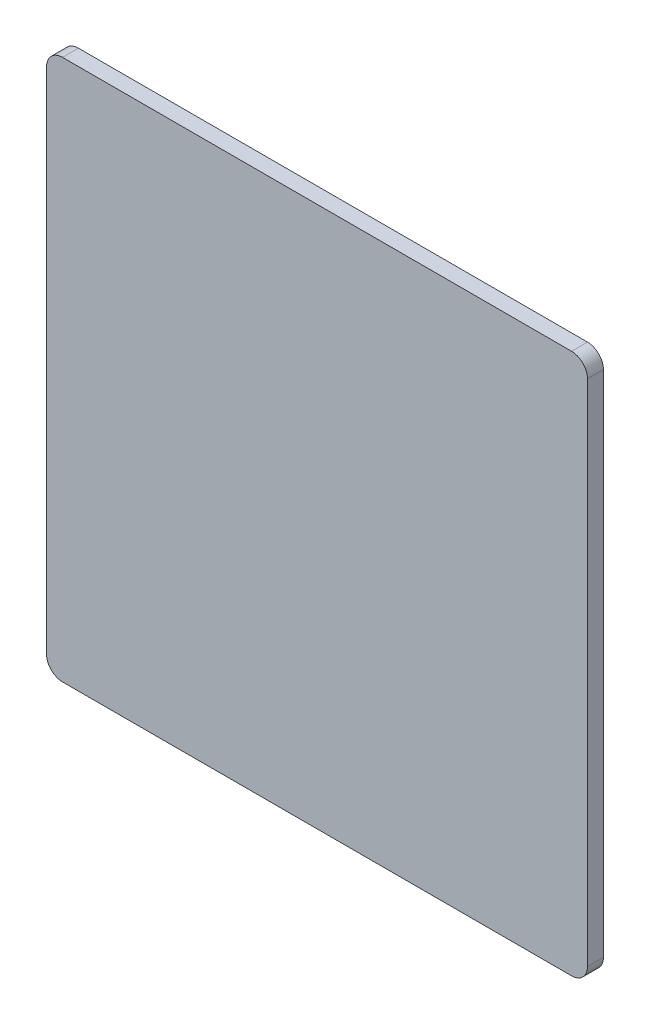
ISO-10303-21;
HEADER;
FILE_DESCRIPTION(('STEP AP214'),'2;1');
FILE_NAME('part.step','',(''),(''),'','','');
FILE_SCHEMA(('AUTOMOTIVE_DESIGN { 1 0 10303 214 1 1 1 1 }'));
ENDSEC;
DATA;
#1=APPLICATION_CONTEXT('core data for automotive mechanical design processes');
#2=APPLICATION_PROTOCOL_DEFINITION('international standard','automotive_design',2000,#1);
#3=PRODUCT_CONTEXT('',#1,'mechanical');
#4=PRODUCT('Part','Part','',(#3));
#5=PRODUCT_RELATED_PRODUCT_CATEGORY('part','',(#4));
#6=PRODUCT_DEFINITION_FORMATION('','',#4);
#7=PRODUCT_DEFINITION_CONTEXT('part definition',#1,'design');
#8=PRODUCT_DEFINITION('design','',#6,#7);
#9=PRODUCT_DEFINITION_SHAPE('','',#8);
#10=(LENGTH_UNIT() NAMED_UNIT(*) SI_UNIT(.MILLI.,.METRE.));
#11=(NAMED_UNIT(*) PLANE_ANGLE_UNIT() SI_UNIT($,.RADIAN.));
#12=(NAMED_UNIT(*) SI_UNIT($,.STERADIAN.) SOLID_ANGLE_UNIT());
#13=UNCERTAINTY_MEASURE_WITH_UNIT(LENGTH_MEASURE(1.E-05),#10,'distance_accuracy_value','');
#14=(GEOMETRIC_REPRESENTATION_CONTEXT(3) GLOBAL_UNCERTAINTY_ASSIGNED_CONTEXT((#13)) GLOBAL_UNIT_ASSIGNED_CONTEXT((#10,
#11,#12)) REPRESENTATION_CONTEXT('',''));
#15=CARTESIAN_POINT('',(0.,0.,0.));
#16=DIRECTION('',(0.,0.,1.));
#17=DIRECTION('',(1.,0.,0.));
#18=AXIS2_PLACEMENT_3D('',#15,#16,#17);
#19=CARTESIAN_POINT('',(0.,12.75,-0.25));
#20=DIRECTION('',(0.,0.,1.));
#21=DIRECTION('',(1.,0.,0.));
#22=AXIS2_PLACEMENT_3D('',#19,#20,#21);
#23=PLANE('',#22);
#24=DIRECTION('',(0.,1.,0.));
#25=VECTOR('',#24,1.);
#26=CARTESIAN_POINT('',(-4.25,12.75,-0.25));
#27=LINE('',#26,#25);
#28=CARTESIAN_POINT('',(-4.25,16.75,-0.25));
#29=VERTEX_POINT('',#28);
#30=CARTESIAN_POINT('',(-4.25,8.75,-0.25));
#31=VERTEX_POINT('',#30);
#32=EDGE_CURVE('E82',#29,#31,#27,.F.);
#33=ORIENTED_EDGE('',*,*,#32,.F.);
#34=CARTESIAN_POINT('',(-4.,16.75,-0.25));
#35=DIRECTION('',(0.,0.,-1.));
#36=DIRECTION('',(-1.,0.,0.));
#37=AXIS2_PLACEMENT_3D('',#34,#35,#36);
#38=CIRCLE('',#37,0.25);
#39=CARTESIAN_POINT('',(-4.,17.,-0.25));
#40=VERTEX_POINT('',#39);
#41=EDGE_CURVE('E107',#40,#29,#38,.F.);
#42=ORIENTED_EDGE('',*,*,#41,.F.);
#43=DIRECTION('',(1.,0.,0.));
#44=VECTOR('',#43,1.);
#45=CARTESIAN_POINT('',(0.,17.,-0.25));
#46=LINE('',#45,#44);
#47=CARTESIAN_POINT('',(4.,17.,-0.25));
#48=VERTEX_POINT('',#47);
#49=EDGE_CURVE('E104',#48,#40,#46,.F.);
#50=ORIENTED_EDGE('',*,*,#49,.F.);
#51=CARTESIAN_POINT('',(4.,16.75,-0.25));
#52=DIRECTION('',(0.,0.,-1.));
#53=DIRECTION('',(-1.,0.,0.));
#54=AXIS2_PLACEMENT_3D('',#51,#52,#53);
#55=CIRCLE('',#54,0.25);
#56=CARTESIAN_POINT('',(4.25,16.75,-0.25));
#57=VERTEX_POINT('',#56);
#58=EDGE_CURVE('E112',#57,#48,#55,.F.);
#59=ORIENTED_EDGE('',*,*,#58,.F.);
#60=DIRECTION('',(0.,1.,0.));
#61=VECTOR('',#60,1.);
#62=CARTESIAN_POINT('',(4.25,12.75,-0.25));
#63=LINE('',#62,#61);
#64=CARTESIAN_POINT('',(4.25,8.75,-0.25));
#65=VERTEX_POINT('',#64);
#66=EDGE_CURVE('E109',#65,#57,#63,.T.);
#67=ORIENTED_EDGE('',*,*,#66,.F.);
#68=CARTESIAN_POINT('',(4.,8.75,-0.25));
#69=DIRECTION('',(0.,0.,-1.));
#70=DIRECTION('',(-1.,0.,0.));
#71=AXIS2_PLACEMENT_3D('',#68,#69,#70);
#72=CIRCLE('',#71,0.25);
#73=CARTESIAN_POINT('',(4.,8.5,-0.25));
#74=VERTEX_POINT('',#73);
#75=EDGE_CURVE('E115',#74,#65,#72,.F.);
#76=ORIENTED_EDGE('',*,*,#75,.F.);
#77=DIRECTION('',(1.,0.,0.));
#78=VECTOR('',#77,1.);
#79=CARTESIAN_POINT('',(0.,8.5,-0.25));
#80=LINE('',#79,#78);
#81=CARTESIAN_POINT('',(-4.,8.5,-0.25));
#82=VERTEX_POINT('',#81);
#83=EDGE_CURVE('E84',#82,#74,#80,.T.);
#84=ORIENTED_EDGE('',*,*,#83,.F.);
#85=CARTESIAN_POINT('',(-4.,8.75,-0.25));
#86=DIRECTION('',(0.,0.,-1.));
#87=DIRECTION('',(-1.,0.,0.));
#88=AXIS2_PLACEMENT_3D('',#85,#86,#87);
#89=CIRCLE('',#88,0.25);
#90=EDGE_CURVE('E20',#31,#82,#89,.F.);
#91=ORIENTED_EDGE('',*,*,#90,.F.);
#92=EDGE_LOOP('',(#33,#42,#50,#59,#67,#76,#84,#91));
#93=FACE_BOUND('',#92,.T.);
#94=ADVANCED_FACE('F17',(#93),#23,.F.);
#95=CARTESIAN_POINT('',(-4.,8.75,0.));
#96=DIRECTION('',(0.,0.,-1.));
#97=DIRECTION('',(-1.,0.,0.));
#98=AXIS2_PLACEMENT_3D('',#95,#96,#97);
#99=CYLINDRICAL_SURFACE('',#98,0.25);
#100=CARTESIAN_POINT('',(-4.,8.75,0.));
#101=DIRECTION('',(0.,0.,-1.));
#102=DIRECTION('',(-1.,0.,0.));
#103=AXIS2_PLACEMENT_3D('',#100,#101,#102);
#104=CIRCLE('',#103,0.25);
#105=CARTESIAN_POINT('',(-4.25,8.75,0.));
#106=VERTEX_POINT('',#105);
#107=CARTESIAN_POINT('',(-4.,8.5,0.));
#108=VERTEX_POINT('',#107);
#109=EDGE_CURVE('E92',#106,#108,#104,.F.);
#110=ORIENTED_EDGE('',*,*,#109,.F.);
#111=DIRECTION('',(0.,0.,1.));
#112=VECTOR('',#111,1.);
#113=CARTESIAN_POINT('',(-4.25,8.75,0.));
#114=LINE('',#113,#112);
#115=EDGE_CURVE('E89',#31,#106,#114,.T.);
#116=ORIENTED_EDGE('',*,*,#115,.F.);
#117=ORIENTED_EDGE('',*,*,#90,.T.);
#118=DIRECTION('',(0.,0.,-1.));
#119=VECTOR('',#118,1.);
#120=CARTESIAN_POINT('',(-4.,8.5,0.));
#121=LINE('',#120,#119);
#122=EDGE_CURVE('E87',#108,#82,#121,.T.);
#123=ORIENTED_EDGE('',*,*,#122,.F.);
#124=EDGE_LOOP('',(#110,#116,#117,#123));
#125=FACE_BOUND('',#124,.T.);
#126=ADVANCED_FACE('F90',(#125),#99,.T.);
#127=CARTESIAN_POINT('',(0.,8.5,0.));
#128=DIRECTION('',(0.,-1.,0.));
#129=DIRECTION('',(0.,0.,-1.));
#130=AXIS2_PLACEMENT_3D('',#127,#128,#129);
#131=PLANE('',#130);
#132=DIRECTION('',(0.,0.,-1.));
#133=VECTOR('',#132,1.);
#134=CARTESIAN_POINT('',(4.,8.5,0.));
#135=LINE('',#134,#133);
#136=CARTESIAN_POINT('',(4.,8.5,0.));
#137=VERTEX_POINT('',#136);
#138=EDGE_CURVE('E128',#137,#74,#135,.T.);
#139=ORIENTED_EDGE('',*,*,#138,.F.);
#140=DIRECTION('',(1.,0.,0.));
#141=VECTOR('',#140,1.);
#142=CARTESIAN_POINT('',(0.,8.5,0.));
#143=LINE('',#142,#141);
#144=EDGE_CURVE('E98',#108,#137,#143,.T.);
#145=ORIENTED_EDGE('',*,*,#144,.F.);
#146=ORIENTED_EDGE('',*,*,#122,.T.);
#147=ORIENTED_EDGE('',*,*,#83,.T.);
#148=EDGE_LOOP('',(#139,#145,#146,#147));
#149=FACE_BOUND('',#148,.T.);
#150=ADVANCED_FACE('F217',(#149),#131,.T.);
#151=CARTESIAN_POINT('',(4.,8.75,0.));
#152=DIRECTION('',(0.,0.,-1.));
#153=DIRECTION('',(-1.,0.,0.));
#154=AXIS2_PLACEMENT_3D('',#151,#152,#153);
#155=CYLINDRICAL_SURFACE('',#154,0.25);
#156=CARTESIAN_POINT('',(4.,8.75,0.));
#157=DIRECTION('',(0.,0.,-1.));
#158=DIRECTION('',(-1.,0.,0.));
#159=AXIS2_PLACEMENT_3D('',#156,#157,#158);
#160=CIRCLE('',#159,0.25);
#161=CARTESIAN_POINT('',(4.25,8.75,0.));
#162=VERTEX_POINT('',#161);
#163=EDGE_CURVE('E123',#137,#162,#160,.F.);
#164=ORIENTED_EDGE('',*,*,#163,.F.);
#165=ORIENTED_EDGE('',*,*,#138,.T.);
#166=ORIENTED_EDGE('',*,*,#75,.T.);
#167=DIRECTION('',(0.,0.,-1.));
#168=VECTOR('',#167,1.);
#169=CARTESIAN_POINT('',(4.25,8.75,0.));
#170=LINE('',#169,#168);
#171=EDGE_CURVE('E113',#162,#65,#170,.T.);
#172=ORIENTED_EDGE('',*,*,#171,.F.);
#173=EDGE_LOOP('',(#164,#165,#166,#172));
#174=FACE_BOUND('',#173,.T.);
#175=ADVANCED_FACE('F207',(#174),#155,.T.);
#176=CARTESIAN_POINT('',(4.25,12.75,0.));
#177=DIRECTION('',(1.,0.,0.));
#178=DIRECTION('',(0.,0.,-1.));
#179=AXIS2_PLACEMENT_3D('',#176,#177,#178);
#180=PLANE('',#179);
#181=DIRECTION('',(0.,0.,-1.));
#182=VECTOR('',#181,1.);
#183=CARTESIAN_POINT('',(4.25,16.75,0.));
#184=LINE('',#183,#182);
#185=CARTESIAN_POINT('',(4.25,16.75,0.));
#186=VERTEX_POINT('',#185);
#187=EDGE_CURVE('E127',#186,#57,#184,.T.);
#188=ORIENTED_EDGE('',*,*,#187,.F.);
#189=DIRECTION('',(0.,1.,0.));
#190=VECTOR('',#189,1.);
#191=CARTESIAN_POINT('',(4.25,12.75,0.));
#192=LINE('',#191,#190);
#193=EDGE_CURVE('E122',#162,#186,#192,.T.);
#194=ORIENTED_EDGE('',*,*,#193,.F.);
#195=ORIENTED_EDGE('',*,*,#171,.T.);
#196=ORIENTED_EDGE('',*,*,#66,.T.);
#197=EDGE_LOOP('',(#188,#194,#195,#196));
#198=FACE_BOUND('',#197,.T.);
#199=ADVANCED_FACE('F197',(#198),#180,.T.);
#200=CARTESIAN_POINT('',(4.,16.75,0.));
#201=DIRECTION('',(0.,0.,-1.));
#202=DIRECTION('',(-1.,0.,0.));
#203=AXIS2_PLACEMENT_3D('',#200,#201,#202);
#204=CYLINDRICAL_SURFACE('',#203,0.25);
#205=CARTESIAN_POINT('',(4.,16.75,0.));
#206=DIRECTION('',(0.,0.,-1.));
#207=DIRECTION('',(-1.,0.,0.));
#208=AXIS2_PLACEMENT_3D('',#205,#206,#207);
#209=CIRCLE('',#208,0.25);
#210=CARTESIAN_POINT('',(4.,17.,0.));
#211=VERTEX_POINT('',#210);
#212=EDGE_CURVE('E119',#186,#211,#209,.F.);
#213=ORIENTED_EDGE('',*,*,#212,.F.);
#214=ORIENTED_EDGE('',*,*,#187,.T.);
#215=ORIENTED_EDGE('',*,*,#58,.T.);
#216=DIRECTION('',(0.,0.,1.));
#217=VECTOR('',#216,1.);
#218=CARTESIAN_POINT('',(4.,17.,0.));
#219=LINE('',#218,#217);
#220=EDGE_CURVE('E108',#211,#48,#219,.F.);
#221=ORIENTED_EDGE('',*,*,#220,.F.);
#222=EDGE_LOOP('',(#213,#214,#215,#221));
#223=FACE_BOUND('',#222,.T.);
#224=ADVANCED_FACE('F163',(#223),#204,.T.);
#225=CARTESIAN_POINT('',(0.,17.,0.));
#226=DIRECTION('',(0.,1.,0.));
#227=DIRECTION('',(0.,0.,1.));
#228=AXIS2_PLACEMENT_3D('',#225,#226,#227);
#229=PLANE('',#228);
#230=ORIENTED_EDGE('',*,*,#220,.T.);
#231=ORIENTED_EDGE('',*,*,#49,.T.);
#232=DIRECTION('',(0.,0.,-1.));
#233=VECTOR('',#232,1.);
#234=CARTESIAN_POINT('',(-4.,17.,0.));
#235=LINE('',#234,#233);
#236=CARTESIAN_POINT('',(-4.,17.,0.));
#237=VERTEX_POINT('',#236);
#238=EDGE_CURVE('E94',#237,#40,#235,.T.);
#239=ORIENTED_EDGE('',*,*,#238,.F.);
#240=DIRECTION('',(1.,0.,0.));
#241=VECTOR('',#240,1.);
#242=CARTESIAN_POINT('',(0.,17.,0.));
#243=LINE('',#242,#241);
#244=EDGE_CURVE('E118',#211,#237,#243,.F.);
#245=ORIENTED_EDGE('',*,*,#244,.F.);
#246=EDGE_LOOP('',(#230,#231,#239,#245));
#247=FACE_BOUND('',#246,.T.);
#248=ADVANCED_FACE('F152',(#247),#229,.T.);
#249=CARTESIAN_POINT('',(-4.,16.75,0.));
#250=DIRECTION('',(0.,0.,-1.));
#251=DIRECTION('',(-1.,0.,0.));
#252=AXIS2_PLACEMENT_3D('',#249,#250,#251);
#253=CYLINDRICAL_SURFACE('',#252,0.25);
#254=CARTESIAN_POINT('',(-4.,16.75,0.));
#255=DIRECTION('',(0.,0.,-1.));
#256=DIRECTION('',(-1.,0.,0.));
#257=AXIS2_PLACEMENT_3D('',#254,#255,#256);
#258=CIRCLE('',#257,0.25);
#259=CARTESIAN_POINT('',(-4.25,16.75,0.));
#260=VERTEX_POINT('',#259);
#261=EDGE_CURVE('E26',#237,#260,#258,.F.);
#262=ORIENTED_EDGE('',*,*,#261,.F.);
#263=ORIENTED_EDGE('',*,*,#238,.T.);
#264=ORIENTED_EDGE('',*,*,#41,.T.);
#265=DIRECTION('',(0.,0.,1.));
#266=VECTOR('',#265,1.);
#267=CARTESIAN_POINT('',(-4.25,16.75,0.));
#268=LINE('',#267,#266);
#269=EDGE_CURVE('E35',#260,#29,#268,.F.);
#270=ORIENTED_EDGE('',*,*,#269,.F.);
#271=EDGE_LOOP('',(#262,#263,#264,#270));
#272=FACE_BOUND('',#271,.T.);
#273=ADVANCED_FACE('F154',(#272),#253,.T.);
#274=CARTESIAN_POINT('',(-4.25,12.75,0.));
#275=DIRECTION('',(-1.,0.,0.));
#276=DIRECTION('',(0.,0.,1.));
#277=AXIS2_PLACEMENT_3D('',#274,#275,#276);
#278=PLANE('',#277);
#279=ORIENTED_EDGE('',*,*,#269,.T.);
#280=ORIENTED_EDGE('',*,*,#32,.T.);
#281=ORIENTED_EDGE('',*,*,#115,.T.);
#282=DIRECTION('',(0.,1.,0.));
#283=VECTOR('',#282,1.);
#284=CARTESIAN_POINT('',(-4.25,12.75,0.));
#285=LINE('',#284,#283);
#286=EDGE_CURVE('E11',#260,#106,#285,.F.);
#287=ORIENTED_EDGE('',*,*,#286,.F.);
#288=EDGE_LOOP('',(#279,#280,#281,#287));
#289=FACE_BOUND('',#288,.T.);
#290=ADVANCED_FACE('F96',(#289),#278,.T.);
#291=CARTESIAN_POINT('',(0.,12.75,0.));
#292=DIRECTION('',(0.,0.,1.));
#293=DIRECTION('',(1.,0.,0.));
#294=AXIS2_PLACEMENT_3D('',#291,#292,#293);
#295=PLANE('',#294);
#296=ORIENTED_EDGE('',*,*,#261,.T.);
#297=ORIENTED_EDGE('',*,*,#286,.T.);
#298=ORIENTED_EDGE('',*,*,#109,.T.);
#299=ORIENTED_EDGE('',*,*,#144,.T.);
#300=ORIENTED_EDGE('',*,*,#163,.T.);
#301=ORIENTED_EDGE('',*,*,#193,.T.);
#302=ORIENTED_EDGE('',*,*,#212,.T.);
#303=ORIENTED_EDGE('',*,*,#244,.T.);
#304=EDGE_LOOP('',(#296,#297,#298,#299,#300,#301,#302,#303));
#305=FACE_BOUND('',#304,.T.);
#306=ADVANCED_FACE('F149',(#305),#295,.T.);
#307=CLOSED_SHELL('',(#94,#126,#150,#175,#199,#224,#248,#273,#290,#306));
#308=MANIFOLD_SOLID_BREP('B1',#307);
#309=ADVANCED_BREP_SHAPE_REPRESENTATION('',(#18,#308),#14);
#310=SHAPE_DEFINITION_REPRESENTATION(#9,#309);
ENDSEC;
END-ISO-10303-21;
